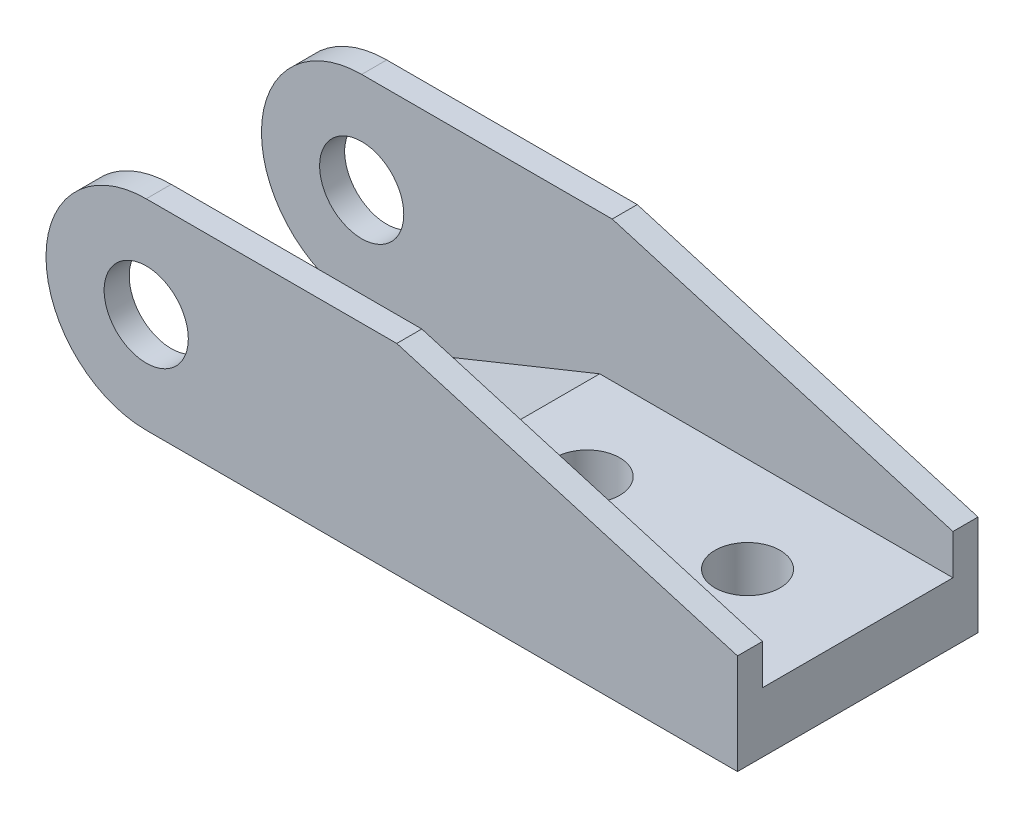
ISO-10303-21;
HEADER;
FILE_DESCRIPTION(('STEP AP214'),'2;1');
FILE_NAME('part.step','',(''),(''),'','','');
FILE_SCHEMA(('AUTOMOTIVE_DESIGN { 1 0 10303 214 1 1 1 1 }'));
ENDSEC;
DATA;
#1=APPLICATION_CONTEXT('core data for automotive mechanical design processes');
#2=APPLICATION_PROTOCOL_DEFINITION('international standard','automotive_design',2000,#1);
#3=PRODUCT_CONTEXT('',#1,'mechanical');
#4=PRODUCT('Part','Part','',(#3));
#5=PRODUCT_RELATED_PRODUCT_CATEGORY('part','',(#4));
#6=PRODUCT_DEFINITION_FORMATION('','',#4);
#7=PRODUCT_DEFINITION_CONTEXT('part definition',#1,'design');
#8=PRODUCT_DEFINITION('design','',#6,#7);
#9=PRODUCT_DEFINITION_SHAPE('','',#8);
#10=(LENGTH_UNIT() NAMED_UNIT(*) SI_UNIT(.MILLI.,.METRE.));
#11=(NAMED_UNIT(*) PLANE_ANGLE_UNIT() SI_UNIT($,.RADIAN.));
#12=(NAMED_UNIT(*) SI_UNIT($,.STERADIAN.) SOLID_ANGLE_UNIT());
#13=UNCERTAINTY_MEASURE_WITH_UNIT(LENGTH_MEASURE(1.E-05),#10,'distance_accuracy_value','');
#14=(GEOMETRIC_REPRESENTATION_CONTEXT(3) GLOBAL_UNCERTAINTY_ASSIGNED_CONTEXT((#13)) GLOBAL_UNIT_ASSIGNED_CONTEXT((#10,
#11,#12)) REPRESENTATION_CONTEXT('',''));
#15=CARTESIAN_POINT('',(0.,0.,0.));
#16=DIRECTION('',(0.,0.,1.));
#17=DIRECTION('',(1.,0.,0.));
#18=AXIS2_PLACEMENT_3D('',#15,#16,#17);
#19=CARTESIAN_POINT('',(-12.25,5.,6.));
#20=DIRECTION('',(0.,0.,-1.));
#21=DIRECTION('',(-1.,0.,0.));
#22=AXIS2_PLACEMENT_3D('',#19,#20,#21);
#23=CYLINDRICAL_SURFACE('',#22,5.);
#24=CARTESIAN_POINT('',(-12.25,5.,4.75));
#25=DIRECTION('',(0.,0.,1.));
#26=DIRECTION('',(1.,0.,0.));
#27=AXIS2_PLACEMENT_3D('',#24,#25,#26);
#28=CIRCLE('',#27,5.);
#29=CARTESIAN_POINT('',(-12.25,0.,4.75));
#30=VERTEX_POINT('',#29);
#31=CARTESIAN_POINT('',(-17.25,5.,4.75));
#32=VERTEX_POINT('',#31);
#33=EDGE_CURVE('E163',#30,#32,#28,.F.);
#34=ORIENTED_EDGE('',*,*,#33,.F.);
#35=DIRECTION('',(0.,0.,1.));
#36=VECTOR('',#35,1.);
#37=CARTESIAN_POINT('',(-12.25,0.,-6.));
#38=LINE('',#37,#36);
#39=CARTESIAN_POINT('',(-12.25,0.,6.));
#40=VERTEX_POINT('',#39);
#41=EDGE_CURVE('E187',#40,#30,#38,.F.);
#42=ORIENTED_EDGE('',*,*,#41,.F.);
#43=CARTESIAN_POINT('',(-12.25,5.,6.));
#44=DIRECTION('',(0.,0.,-1.));
#45=DIRECTION('',(-1.,0.,0.));
#46=AXIS2_PLACEMENT_3D('',#43,#44,#45);
#47=CIRCLE('',#46,5.);
#48=CARTESIAN_POINT('',(-17.25,5.,6.));
#49=VERTEX_POINT('',#48);
#50=EDGE_CURVE('E178',#49,#40,#47,.F.);
#51=ORIENTED_EDGE('',*,*,#50,.F.);
#52=DIRECTION('',(0.,0.,1.));
#53=VECTOR('',#52,1.);
#54=CARTESIAN_POINT('',(-17.25,5.,6.));
#55=LINE('',#54,#53);
#56=EDGE_CURVE('E193',#32,#49,#55,.T.);
#57=ORIENTED_EDGE('',*,*,#56,.F.);
#58=EDGE_LOOP('',(#34,#42,#51,#57));
#59=FACE_BOUND('',#58,.T.);
#60=ADVANCED_FACE('F32',(#59),#23,.T.);
#61=CARTESIAN_POINT('',(0.,10.,0.));
#62=DIRECTION('',(0.,-1.,0.));
#63=DIRECTION('',(0.,0.,-1.));
#64=AXIS2_PLACEMENT_3D('',#61,#62,#63);
#65=PLANE('',#64);
#66=DIRECTION('',(1.,0.,0.));
#67=VECTOR('',#66,1.);
#68=CARTESIAN_POINT('',(-17.25,10.,6.));
#69=LINE('',#68,#67);
#70=CARTESIAN_POINT('',(-12.25,10.,6.));
#71=VERTEX_POINT('',#70);
#72=CARTESIAN_POINT('',(0.25,10.,6.));
#73=VERTEX_POINT('',#72);
#74=EDGE_CURVE('E153',#71,#73,#69,.T.);
#75=ORIENTED_EDGE('',*,*,#74,.T.);
#76=DIRECTION('',(0.,0.,1.));
#77=VECTOR('',#76,1.);
#78=CARTESIAN_POINT('',(0.25,10.,-6.));
#79=LINE('',#78,#77);
#80=CARTESIAN_POINT('',(0.25,10.,4.75));
#81=VERTEX_POINT('',#80);
#82=EDGE_CURVE('E138',#81,#73,#79,.T.);
#83=ORIENTED_EDGE('',*,*,#82,.F.);
#84=DIRECTION('',(1.,0.,0.));
#85=VECTOR('',#84,1.);
#86=CARTESIAN_POINT('',(17.25,10.,4.75));
#87=LINE('',#86,#85);
#88=CARTESIAN_POINT('',(-12.25,10.,4.75));
#89=VERTEX_POINT('',#88);
#90=EDGE_CURVE('E236',#89,#81,#87,.T.);
#91=ORIENTED_EDGE('',*,*,#90,.F.);
#92=DIRECTION('',(0.,0.,1.));
#93=VECTOR('',#92,1.);
#94=CARTESIAN_POINT('',(-12.25,10.,0.));
#95=LINE('',#94,#93);
#96=EDGE_CURVE('E175',#89,#71,#95,.T.);
#97=ORIENTED_EDGE('',*,*,#96,.T.);
#98=EDGE_LOOP('',(#75,#83,#91,#97));
#99=FACE_BOUND('',#98,.T.);
#100=ADVANCED_FACE('F264',(#99),#65,.F.);
#101=CARTESIAN_POINT('',(-12.25,5.,0.));
#102=DIRECTION('',(0.,0.,1.));
#103=DIRECTION('',(1.,0.,0.));
#104=AXIS2_PLACEMENT_3D('',#101,#102,#103);
#105=CYLINDRICAL_SURFACE('',#104,5.);
#106=CARTESIAN_POINT('',(-12.25,5.,4.75));
#107=DIRECTION('',(0.,0.,1.));
#108=DIRECTION('',(1.,0.,0.));
#109=AXIS2_PLACEMENT_3D('',#106,#107,#108);
#110=CIRCLE('',#109,5.);
#111=EDGE_CURVE('E195',#32,#89,#110,.F.);
#112=ORIENTED_EDGE('',*,*,#111,.F.);
#113=ORIENTED_EDGE('',*,*,#56,.T.);
#114=CARTESIAN_POINT('',(-12.25,5.,6.));
#115=DIRECTION('',(0.,0.,-1.));
#116=DIRECTION('',(-1.,0.,0.));
#117=AXIS2_PLACEMENT_3D('',#114,#115,#116);
#118=CIRCLE('',#117,5.);
#119=EDGE_CURVE('E180',#71,#49,#118,.F.);
#120=ORIENTED_EDGE('',*,*,#119,.F.);
#121=ORIENTED_EDGE('',*,*,#96,.F.);
#122=EDGE_LOOP('',(#112,#113,#120,#121));
#123=FACE_BOUND('',#122,.T.);
#124=ADVANCED_FACE('F254',(#123),#105,.T.);
#125=CARTESIAN_POINT('',(17.25,10.,6.));
#126=DIRECTION('',(-1.,0.,0.));
#127=DIRECTION('',(0.,0.,1.));
#128=AXIS2_PLACEMENT_3D('',#125,#126,#127);
#129=PLANE('',#128);
#130=DIRECTION('',(0.,-1.,0.));
#131=VECTOR('',#130,1.);
#132=CARTESIAN_POINT('',(17.25,10.,-6.));
#133=LINE('',#132,#131);
#134=CARTESIAN_POINT('',(17.25,5.,-6.));
#135=VERTEX_POINT('',#134);
#136=CARTESIAN_POINT('',(17.25,0.,-6.));
#137=VERTEX_POINT('',#136);
#138=EDGE_CURVE('E173',#135,#137,#133,.T.);
#139=ORIENTED_EDGE('',*,*,#138,.F.);
#140=DIRECTION('',(0.,0.,1.));
#141=VECTOR('',#140,1.);
#142=CARTESIAN_POINT('',(17.25,5.,-6.));
#143=LINE('',#142,#141);
#144=CARTESIAN_POINT('',(17.25,5.,-4.75));
#145=VERTEX_POINT('',#144);
#146=EDGE_CURVE('E134',#135,#145,#143,.T.);
#147=ORIENTED_EDGE('',*,*,#146,.T.);
#148=DIRECTION('',(0.,1.,0.));
#149=VECTOR('',#148,1.);
#150=CARTESIAN_POINT('',(17.25,3.,-4.75));
#151=LINE('',#150,#149);
#152=CARTESIAN_POINT('',(17.25,3.,-4.75));
#153=VERTEX_POINT('',#152);
#154=EDGE_CURVE('E242',#153,#145,#151,.T.);
#155=ORIENTED_EDGE('',*,*,#154,.F.);
#156=DIRECTION('',(0.,0.,-1.));
#157=VECTOR('',#156,1.);
#158=CARTESIAN_POINT('',(17.25,3.,-4.75));
#159=LINE('',#158,#157);
#160=CARTESIAN_POINT('',(17.25,3.,4.75));
#161=VERTEX_POINT('',#160);
#162=EDGE_CURVE('E219',#161,#153,#159,.T.);
#163=ORIENTED_EDGE('',*,*,#162,.F.);
#164=DIRECTION('',(0.,1.,0.));
#165=VECTOR('',#164,1.);
#166=CARTESIAN_POINT('',(17.25,3.,4.75));
#167=LINE('',#166,#165);
#168=CARTESIAN_POINT('',(17.25,5.,4.75));
#169=VERTEX_POINT('',#168);
#170=EDGE_CURVE('E245',#161,#169,#167,.T.);
#171=ORIENTED_EDGE('',*,*,#170,.T.);
#172=CARTESIAN_POINT('',(17.25,5.,6.));
#173=VERTEX_POINT('',#172);
#174=EDGE_CURVE('E48',#169,#173,#143,.T.);
#175=ORIENTED_EDGE('',*,*,#174,.T.);
#176=DIRECTION('',(0.,-1.,0.));
#177=VECTOR('',#176,1.);
#178=CARTESIAN_POINT('',(17.25,10.,6.));
#179=LINE('',#178,#177);
#180=CARTESIAN_POINT('',(17.25,0.,6.));
#181=VERTEX_POINT('',#180);
#182=EDGE_CURVE('E157',#173,#181,#179,.T.);
#183=ORIENTED_EDGE('',*,*,#182,.T.);
#184=DIRECTION('',(0.,0.,-1.));
#185=VECTOR('',#184,1.);
#186=CARTESIAN_POINT('',(17.25,0.,6.));
#187=LINE('',#186,#185);
#188=EDGE_CURVE('E166',#181,#137,#187,.T.);
#189=ORIENTED_EDGE('',*,*,#188,.T.);
#190=EDGE_LOOP('',(#139,#147,#155,#163,#171,#175,#183,#189));
#191=FACE_BOUND('',#190,.T.);
#192=ADVANCED_FACE('F288',(#191),#129,.F.);
#193=CARTESIAN_POINT('',(-17.25,10.,-6.));
#194=DIRECTION('',(0.,0.,1.));
#195=DIRECTION('',(1.,0.,0.));
#196=AXIS2_PLACEMENT_3D('',#193,#194,#195);
#197=PLANE('',#196);
#198=CARTESIAN_POINT('',(-12.25,5.,-6.));
#199=DIRECTION('',(0.,0.,1.));
#200=DIRECTION('',(1.,0.,0.));
#201=AXIS2_PLACEMENT_3D('',#198,#199,#200);
#202=CIRCLE('',#201,2.1);
#203=CARTESIAN_POINT('',(-10.15,5.,-6.));
#204=VERTEX_POINT('',#203);
#205=EDGE_CURVE('E303',#204,#204,#202,.T.);
#206=ORIENTED_EDGE('',*,*,#205,.T.);
#207=EDGE_LOOP('',(#206));
#208=FACE_BOUND('',#207,.T.);
#209=DIRECTION('',(-1.,0.,0.));
#210=VECTOR('',#209,1.);
#211=CARTESIAN_POINT('',(-17.25,10.,-6.));
#212=LINE('',#211,#210);
#213=CARTESIAN_POINT('',(0.25,10.,-6.));
#214=VERTEX_POINT('',#213);
#215=CARTESIAN_POINT('',(-12.25,10.,-6.));
#216=VERTEX_POINT('',#215);
#217=EDGE_CURVE('E145',#214,#216,#212,.T.);
#218=ORIENTED_EDGE('',*,*,#217,.F.);
#219=DIRECTION('',(0.959365501571271,-0.28216632399155,0.));
#220=VECTOR('',#219,1.);
#221=CARTESIAN_POINT('',(0.25,10.,-6.));
#222=LINE('',#221,#220);
#223=EDGE_CURVE('E131',#214,#135,#222,.T.);
#224=ORIENTED_EDGE('',*,*,#223,.T.);
#225=ORIENTED_EDGE('',*,*,#138,.T.);
#226=DIRECTION('',(-1.,0.,0.));
#227=VECTOR('',#226,1.);
#228=CARTESIAN_POINT('',(-17.25,0.,-6.));
#229=LINE('',#228,#227);
#230=CARTESIAN_POINT('',(-12.25,0.,-6.));
#231=VERTEX_POINT('',#230);
#232=EDGE_CURVE('E160',#137,#231,#229,.T.);
#233=ORIENTED_EDGE('',*,*,#232,.T.);
#234=CARTESIAN_POINT('',(-12.25,5.,-6.));
#235=DIRECTION('',(0.,0.,1.));
#236=DIRECTION('',(1.,0.,0.));
#237=AXIS2_PLACEMENT_3D('',#234,#235,#236);
#238=CIRCLE('',#237,5.);
#239=CARTESIAN_POINT('',(-17.25,5.,-6.));
#240=VERTEX_POINT('',#239);
#241=EDGE_CURVE('E183',#231,#240,#238,.F.);
#242=ORIENTED_EDGE('',*,*,#241,.T.);
#243=CARTESIAN_POINT('',(-12.25,5.,-6.));
#244=DIRECTION('',(0.,0.,1.));
#245=DIRECTION('',(1.,0.,0.));
#246=AXIS2_PLACEMENT_3D('',#243,#244,#245);
#247=CIRCLE('',#246,5.);
#248=EDGE_CURVE('E151',#240,#216,#247,.F.);
#249=ORIENTED_EDGE('',*,*,#248,.T.);
#250=EDGE_LOOP('',(#218,#224,#225,#233,#242,#249));
#251=FACE_BOUND('',#250,.T.);
#252=ADVANCED_FACE('F149',(#208,#251),#197,.F.);
#253=CARTESIAN_POINT('',(-17.25,10.,6.));
#254=DIRECTION('',(0.,0.,-1.));
#255=DIRECTION('',(-1.,0.,0.));
#256=AXIS2_PLACEMENT_3D('',#253,#254,#255);
#257=PLANE('',#256);
#258=CARTESIAN_POINT('',(-12.25,5.,6.));
#259=DIRECTION('',(0.,0.,1.));
#260=DIRECTION('',(1.,0.,0.));
#261=AXIS2_PLACEMENT_3D('',#258,#259,#260);
#262=CIRCLE('',#261,2.1);
#263=CARTESIAN_POINT('',(-10.15,5.,6.));
#264=VERTEX_POINT('',#263);
#265=EDGE_CURVE('E300',#264,#264,#262,.T.);
#266=ORIENTED_EDGE('',*,*,#265,.F.);
#267=EDGE_LOOP('',(#266));
#268=FACE_BOUND('',#267,.T.);
#269=ORIENTED_EDGE('',*,*,#182,.F.);
#270=DIRECTION('',(0.959365501571271,-0.28216632399155,0.));
#271=VECTOR('',#270,1.);
#272=CARTESIAN_POINT('',(0.25,10.,6.));
#273=LINE('',#272,#271);
#274=EDGE_CURVE('E139',#73,#173,#273,.T.);
#275=ORIENTED_EDGE('',*,*,#274,.F.);
#276=ORIENTED_EDGE('',*,*,#74,.F.);
#277=ORIENTED_EDGE('',*,*,#119,.T.);
#278=ORIENTED_EDGE('',*,*,#50,.T.);
#279=DIRECTION('',(1.,0.,0.));
#280=VECTOR('',#279,1.);
#281=CARTESIAN_POINT('',(-17.25,0.,6.));
#282=LINE('',#281,#280);
#283=EDGE_CURVE('E154',#40,#181,#282,.T.);
#284=ORIENTED_EDGE('',*,*,#283,.T.);
#285=EDGE_LOOP('',(#269,#275,#276,#277,#278,#284));
#286=FACE_BOUND('',#285,.T.);
#287=ADVANCED_FACE('F261',(#268,#286),#257,.F.);
#288=DIRECTION('',(-1.,0.,0.));
#289=VECTOR('',#288,1.);
#290=CARTESIAN_POINT('',(17.25,10.,-4.75));
#291=LINE('',#290,#289);
#292=CARTESIAN_POINT('',(0.249999999999999,10.,-4.75));
#293=VERTEX_POINT('',#292);
#294=CARTESIAN_POINT('',(-12.25,10.,-4.75));
#295=VERTEX_POINT('',#294);
#296=EDGE_CURVE('E147',#293,#295,#291,.T.);
#297=ORIENTED_EDGE('',*,*,#296,.F.);
#298=EDGE_CURVE('E56',#214,#293,#79,.T.);
#299=ORIENTED_EDGE('',*,*,#298,.F.);
#300=ORIENTED_EDGE('',*,*,#217,.T.);
#301=EDGE_CURVE('E176',#216,#295,#95,.T.);
#302=ORIENTED_EDGE('',*,*,#301,.T.);
#303=EDGE_LOOP('',(#297,#299,#300,#302));
#304=FACE_BOUND('',#303,.T.);
#305=ADVANCED_FACE('F143',(#304),#65,.F.);
#306=CARTESIAN_POINT('',(0.,0.,0.));
#307=DIRECTION('',(0.,-1.,0.));
#308=DIRECTION('',(0.,0.,-1.));
#309=AXIS2_PLACEMENT_3D('',#306,#307,#308);
#310=PLANE('',#309);
#311=CARTESIAN_POINT('',(11.75,0.,0.));
#312=DIRECTION('',(0.,1.,0.));
#313=DIRECTION('',(0.,0.,1.));
#314=AXIS2_PLACEMENT_3D('',#311,#312,#313);
#315=CIRCLE('',#314,1.625);
#316=CARTESIAN_POINT('',(11.75,0.,1.625));
#317=VERTEX_POINT('',#316);
#318=EDGE_CURVE('E310',#317,#317,#315,.T.);
#319=ORIENTED_EDGE('',*,*,#318,.T.);
#320=EDGE_LOOP('',(#319));
#321=FACE_BOUND('',#320,.T.);
#322=CARTESIAN_POINT('',(3.75,0.,0.));
#323=DIRECTION('',(0.,1.,0.));
#324=DIRECTION('',(0.,0.,1.));
#325=AXIS2_PLACEMENT_3D('',#322,#323,#324);
#326=CIRCLE('',#325,1.625);
#327=CARTESIAN_POINT('',(3.75,0.,1.625));
#328=VERTEX_POINT('',#327);
#329=EDGE_CURVE('E304',#328,#328,#326,.T.);
#330=ORIENTED_EDGE('',*,*,#329,.T.);
#331=EDGE_LOOP('',(#330));
#332=FACE_BOUND('',#331,.T.);
#333=DIRECTION('',(-1.,0.,0.));
#334=VECTOR('',#333,1.);
#335=CARTESIAN_POINT('',(-18.5370657850557,0.,4.75));
#336=LINE('',#335,#334);
#337=CARTESIAN_POINT('',(-7.8,0.,4.75));
#338=VERTEX_POINT('',#337);
#339=EDGE_CURVE('E229',#338,#30,#336,.T.);
#340=ORIENTED_EDGE('',*,*,#339,.F.);
#341=DIRECTION('',(0.,0.,1.));
#342=VECTOR('',#341,1.);
#343=CARTESIAN_POINT('',(-7.8,0.,4.75));
#344=LINE('',#343,#342);
#345=CARTESIAN_POINT('',(-7.8,0.,-4.75));
#346=VERTEX_POINT('',#345);
#347=EDGE_CURVE('E223',#346,#338,#344,.T.);
#348=ORIENTED_EDGE('',*,*,#347,.F.);
#349=DIRECTION('',(1.,0.,0.));
#350=VECTOR('',#349,1.);
#351=CARTESIAN_POINT('',(-18.5370657850557,0.,-4.75));
#352=LINE('',#351,#350);
#353=CARTESIAN_POINT('',(-12.25,0.,-4.75));
#354=VERTEX_POINT('',#353);
#355=EDGE_CURVE('E210',#354,#346,#352,.T.);
#356=ORIENTED_EDGE('',*,*,#355,.F.);
#357=EDGE_CURVE('E186',#354,#231,#38,.F.);
#358=ORIENTED_EDGE('',*,*,#357,.T.);
#359=ORIENTED_EDGE('',*,*,#232,.F.);
#360=ORIENTED_EDGE('',*,*,#188,.F.);
#361=ORIENTED_EDGE('',*,*,#283,.F.);
#362=ORIENTED_EDGE('',*,*,#41,.T.);
#363=EDGE_LOOP('',(#340,#348,#356,#358,#359,#360,#361,#362));
#364=FACE_BOUND('',#363,.T.);
#365=ADVANCED_FACE('F232',(#321,#332,#364),#310,.T.);
#366=ORIENTED_EDGE('',*,*,#357,.F.);
#367=CARTESIAN_POINT('',(-12.25,5.,-4.75));
#368=DIRECTION('',(0.,0.,-1.));
#369=DIRECTION('',(-1.,0.,0.));
#370=AXIS2_PLACEMENT_3D('',#367,#368,#369);
#371=CIRCLE('',#370,5.);
#372=CARTESIAN_POINT('',(-17.25,5.,-4.75));
#373=VERTEX_POINT('',#372);
#374=EDGE_CURVE('E248',#373,#354,#371,.F.);
#375=ORIENTED_EDGE('',*,*,#374,.F.);
#376=EDGE_CURVE('E169',#240,#373,#55,.T.);
#377=ORIENTED_EDGE('',*,*,#376,.F.);
#378=ORIENTED_EDGE('',*,*,#241,.F.);
#379=EDGE_LOOP('',(#366,#375,#377,#378));
#380=FACE_BOUND('',#379,.T.);
#381=ADVANCED_FACE('F265',(#380),#23,.T.);
#382=CARTESIAN_POINT('',(-12.25,5.,-4.75));
#383=DIRECTION('',(0.,0.,-1.));
#384=DIRECTION('',(-1.,0.,0.));
#385=AXIS2_PLACEMENT_3D('',#382,#383,#384);
#386=CIRCLE('',#385,5.);
#387=EDGE_CURVE('E190',#295,#373,#386,.F.);
#388=ORIENTED_EDGE('',*,*,#387,.F.);
#389=ORIENTED_EDGE('',*,*,#301,.F.);
#390=ORIENTED_EDGE('',*,*,#248,.F.);
#391=ORIENTED_EDGE('',*,*,#376,.T.);
#392=EDGE_LOOP('',(#388,#389,#390,#391));
#393=FACE_BOUND('',#392,.T.);
#394=ADVANCED_FACE('F273',(#393),#105,.T.);
#395=CARTESIAN_POINT('',(17.25,3.,4.75));
#396=DIRECTION('',(0.,0.,1.));
#397=DIRECTION('',(1.,0.,0.));
#398=AXIS2_PLACEMENT_3D('',#395,#396,#397);
#399=PLANE('',#398);
#400=CARTESIAN_POINT('',(-12.25,5.,4.75));
#401=DIRECTION('',(0.,0.,1.));
#402=DIRECTION('',(1.,0.,0.));
#403=AXIS2_PLACEMENT_3D('',#400,#401,#402);
#404=CIRCLE('',#403,2.1);
#405=CARTESIAN_POINT('',(-10.15,5.,4.75));
#406=VERTEX_POINT('',#405);
#407=EDGE_CURVE('E289',#406,#406,#404,.T.);
#408=ORIENTED_EDGE('',*,*,#407,.T.);
#409=EDGE_LOOP('',(#408));
#410=FACE_BOUND('',#409,.T.);
#411=ORIENTED_EDGE('',*,*,#90,.T.);
#412=DIRECTION('',(0.959365501571271,-0.28216632399155,0.));
#413=VECTOR('',#412,1.);
#414=CARTESIAN_POINT('',(17.7914012738853,4.84076433121019,4.75));
#415=LINE('',#414,#413);
#416=EDGE_CURVE('E293',#81,#169,#415,.T.);
#417=ORIENTED_EDGE('',*,*,#416,.T.);
#418=ORIENTED_EDGE('',*,*,#170,.F.);
#419=DIRECTION('',(1.,0.,0.));
#420=VECTOR('',#419,1.);
#421=CARTESIAN_POINT('',(17.25,3.,4.75));
#422=LINE('',#421,#420);
#423=CARTESIAN_POINT('',(-0.374739439751127,3.,4.75));
#424=VERTEX_POINT('',#423);
#425=EDGE_CURVE('E221',#424,#161,#422,.T.);
#426=ORIENTED_EDGE('',*,*,#425,.F.);
#427=DIRECTION('',(0.927183854566787,0.374606593415913,0.));
#428=VECTOR('',#427,1.);
#429=CARTESIAN_POINT('',(14.7767185549301,9.12158638949099,4.75));
#430=LINE('',#429,#428);
#431=EDGE_CURVE('E200',#424,#338,#430,.F.);
#432=ORIENTED_EDGE('',*,*,#431,.T.);
#433=ORIENTED_EDGE('',*,*,#339,.T.);
#434=ORIENTED_EDGE('',*,*,#33,.T.);
#435=ORIENTED_EDGE('',*,*,#111,.T.);
#436=EDGE_LOOP('',(#411,#417,#418,#426,#432,#433,#434,#435));
#437=FACE_BOUND('',#436,.T.);
#438=ADVANCED_FACE('F228',(#410,#437),#399,.F.);
#439=CARTESIAN_POINT('',(17.25,3.,-4.75));
#440=DIRECTION('',(0.,0.,-1.));
#441=DIRECTION('',(-1.,0.,0.));
#442=AXIS2_PLACEMENT_3D('',#439,#440,#441);
#443=PLANE('',#442);
#444=CARTESIAN_POINT('',(-12.25,5.,-4.75));
#445=DIRECTION('',(0.,0.,-1.));
#446=DIRECTION('',(-1.,0.,0.));
#447=AXIS2_PLACEMENT_3D('',#444,#445,#446);
#448=CIRCLE('',#447,2.1);
#449=CARTESIAN_POINT('',(-14.35,5.,-4.75));
#450=VERTEX_POINT('',#449);
#451=EDGE_CURVE('E36',#450,#450,#448,.T.);
#452=ORIENTED_EDGE('',*,*,#451,.T.);
#453=EDGE_LOOP('',(#452));
#454=FACE_BOUND('',#453,.T.);
#455=ORIENTED_EDGE('',*,*,#154,.T.);
#456=DIRECTION('',(-0.959365501571271,0.28216632399155,0.));
#457=VECTOR('',#456,1.);
#458=CARTESIAN_POINT('',(17.7914012738853,4.84076433121019,-4.75));
#459=LINE('',#458,#457);
#460=EDGE_CURVE('E11',#145,#293,#459,.T.);
#461=ORIENTED_EDGE('',*,*,#460,.T.);
#462=ORIENTED_EDGE('',*,*,#296,.T.);
#463=ORIENTED_EDGE('',*,*,#387,.T.);
#464=ORIENTED_EDGE('',*,*,#374,.T.);
#465=ORIENTED_EDGE('',*,*,#355,.T.);
#466=DIRECTION('',(-0.927183854566787,-0.374606593415913,0.));
#467=VECTOR('',#466,1.);
#468=CARTESIAN_POINT('',(14.7767185549301,9.12158638949099,-4.75));
#469=LINE('',#468,#467);
#470=CARTESIAN_POINT('',(-0.374739439751123,3.,-4.75));
#471=VERTEX_POINT('',#470);
#472=EDGE_CURVE('E41',#346,#471,#469,.F.);
#473=ORIENTED_EDGE('',*,*,#472,.T.);
#474=DIRECTION('',(-1.,0.,0.));
#475=VECTOR('',#474,1.);
#476=CARTESIAN_POINT('',(17.25,3.,-4.75));
#477=LINE('',#476,#475);
#478=EDGE_CURVE('E207',#153,#471,#477,.T.);
#479=ORIENTED_EDGE('',*,*,#478,.F.);
#480=EDGE_LOOP('',(#455,#461,#462,#463,#464,#465,#473,#479));
#481=FACE_BOUND('',#480,.T.);
#482=ADVANCED_FACE('F206',(#454,#481),#443,.F.);
#483=CARTESIAN_POINT('',(0.,3.,0.));
#484=DIRECTION('',(0.,-1.,0.));
#485=DIRECTION('',(0.,0.,-1.));
#486=AXIS2_PLACEMENT_3D('',#483,#484,#485);
#487=PLANE('',#486);
#488=CARTESIAN_POINT('',(11.75,3.,0.));
#489=DIRECTION('',(0.,1.,0.));
#490=DIRECTION('',(0.,0.,1.));
#491=AXIS2_PLACEMENT_3D('',#488,#489,#490);
#492=CIRCLE('',#491,1.625);
#493=CARTESIAN_POINT('',(11.75,3.,1.625));
#494=VERTEX_POINT('',#493);
#495=EDGE_CURVE('E313',#494,#494,#492,.T.);
#496=ORIENTED_EDGE('',*,*,#495,.F.);
#497=EDGE_LOOP('',(#496));
#498=FACE_BOUND('',#497,.T.);
#499=CARTESIAN_POINT('',(3.75,3.,0.));
#500=DIRECTION('',(0.,1.,0.));
#501=DIRECTION('',(0.,0.,1.));
#502=AXIS2_PLACEMENT_3D('',#499,#500,#501);
#503=CIRCLE('',#502,1.625);
#504=CARTESIAN_POINT('',(3.75,3.,1.625));
#505=VERTEX_POINT('',#504);
#506=EDGE_CURVE('E307',#505,#505,#503,.T.);
#507=ORIENTED_EDGE('',*,*,#506,.F.);
#508=EDGE_LOOP('',(#507));
#509=FACE_BOUND('',#508,.T.);
#510=ORIENTED_EDGE('',*,*,#478,.T.);
#511=DIRECTION('',(0.,0.,1.));
#512=VECTOR('',#511,1.);
#513=CARTESIAN_POINT('',(-0.374739439751126,3.,0.));
#514=LINE('',#513,#512);
#515=EDGE_CURVE('E197',#471,#424,#514,.T.);
#516=ORIENTED_EDGE('',*,*,#515,.T.);
#517=ORIENTED_EDGE('',*,*,#425,.T.);
#518=ORIENTED_EDGE('',*,*,#162,.T.);
#519=EDGE_LOOP('',(#510,#516,#517,#518));
#520=FACE_BOUND('',#519,.T.);
#521=ADVANCED_FACE('F216',(#498,#509,#520),#487,.F.);
#522=CARTESIAN_POINT('',(-0.374739439751126,3.,0.));
#523=DIRECTION('',(0.374606593415913,-0.927183854566787,0.));
#524=DIRECTION('',(0.,0.,1.));
#525=AXIS2_PLACEMENT_3D('',#522,#523,#524);
#526=PLANE('',#525);
#527=ORIENTED_EDGE('',*,*,#472,.F.);
#528=ORIENTED_EDGE('',*,*,#347,.T.);
#529=ORIENTED_EDGE('',*,*,#431,.F.);
#530=ORIENTED_EDGE('',*,*,#515,.F.);
#531=EDGE_LOOP('',(#527,#528,#529,#530));
#532=FACE_BOUND('',#531,.T.);
#533=ADVANCED_FACE('F34',(#532),#526,.F.);
#534=CARTESIAN_POINT('',(0.25,10.,-6.));
#535=DIRECTION('',(-0.28216632399155,-0.95936550157127,0.));
#536=DIRECTION('',(0.959365501571271,-0.28216632399155,0.));
#537=AXIS2_PLACEMENT_3D('',#534,#535,#536);
#538=PLANE('',#537);
#539=ORIENTED_EDGE('',*,*,#146,.F.);
#540=ORIENTED_EDGE('',*,*,#223,.F.);
#541=ORIENTED_EDGE('',*,*,#298,.T.);
#542=ORIENTED_EDGE('',*,*,#460,.F.);
#543=EDGE_LOOP('',(#539,#540,#541,#542));
#544=FACE_BOUND('',#543,.T.);
#545=ADVANCED_FACE('F132',(#544),#538,.F.);
#546=ORIENTED_EDGE('',*,*,#82,.T.);
#547=ORIENTED_EDGE('',*,*,#274,.T.);
#548=ORIENTED_EDGE('',*,*,#174,.F.);
#549=ORIENTED_EDGE('',*,*,#416,.F.);
#550=EDGE_LOOP('',(#546,#547,#548,#549));
#551=FACE_BOUND('',#550,.T.);
#552=ADVANCED_FACE('F344',(#551),#538,.F.);
#553=CARTESIAN_POINT('',(-12.25,5.,-6.));
#554=DIRECTION('',(0.,0.,1.));
#555=DIRECTION('',(1.,0.,0.));
#556=AXIS2_PLACEMENT_3D('',#553,#554,#555);
#557=CYLINDRICAL_SURFACE('',#556,2.1);
#558=ORIENTED_EDGE('',*,*,#205,.F.);
#559=EDGE_LOOP('',(#558));
#560=FACE_BOUND('',#559,.T.);
#561=ORIENTED_EDGE('',*,*,#451,.F.);
#562=EDGE_LOOP('',(#561));
#563=FACE_BOUND('',#562,.T.);
#564=ADVANCED_FACE('F339',(#560,#563),#557,.F.);
#565=ORIENTED_EDGE('',*,*,#265,.T.);
#566=EDGE_LOOP('',(#565));
#567=FACE_BOUND('',#566,.T.);
#568=ORIENTED_EDGE('',*,*,#407,.F.);
#569=EDGE_LOOP('',(#568));
#570=FACE_BOUND('',#569,.T.);
#571=ADVANCED_FACE('F333',(#567,#570),#557,.F.);
#572=CARTESIAN_POINT('',(3.75,0.,0.));
#573=DIRECTION('',(0.,1.,0.));
#574=DIRECTION('',(0.,0.,1.));
#575=AXIS2_PLACEMENT_3D('',#572,#573,#574);
#576=CYLINDRICAL_SURFACE('',#575,1.625);
#577=ORIENTED_EDGE('',*,*,#329,.F.);
#578=EDGE_LOOP('',(#577));
#579=FACE_BOUND('',#578,.T.);
#580=ORIENTED_EDGE('',*,*,#506,.T.);
#581=EDGE_LOOP('',(#580));
#582=FACE_BOUND('',#581,.T.);
#583=ADVANCED_FACE('F323',(#579,#582),#576,.F.);
#584=CARTESIAN_POINT('',(11.75,0.,0.));
#585=DIRECTION('',(0.,1.,0.));
#586=DIRECTION('',(0.,0.,1.));
#587=AXIS2_PLACEMENT_3D('',#584,#585,#586);
#588=CYLINDRICAL_SURFACE('',#587,1.625);
#589=ORIENTED_EDGE('',*,*,#318,.F.);
#590=EDGE_LOOP('',(#589));
#591=FACE_BOUND('',#590,.T.);
#592=ORIENTED_EDGE('',*,*,#495,.T.);
#593=EDGE_LOOP('',(#592));
#594=FACE_BOUND('',#593,.T.);
#595=ADVANCED_FACE('F320',(#591,#594),#588,.F.);
#596=CLOSED_SHELL('',(#60,#100,#124,#192,#252,#287,#305,#365,#381,#394,#438,#482,#521,#533,#545,
#552,#564,#571,#583,#595));
#597=MANIFOLD_SOLID_BREP('B2',#596);
#598=ADVANCED_BREP_SHAPE_REPRESENTATION('',(#18,#597),#14);
#599=SHAPE_DEFINITION_REPRESENTATION(#9,#598);
ENDSEC;
END-ISO-10303-21;
